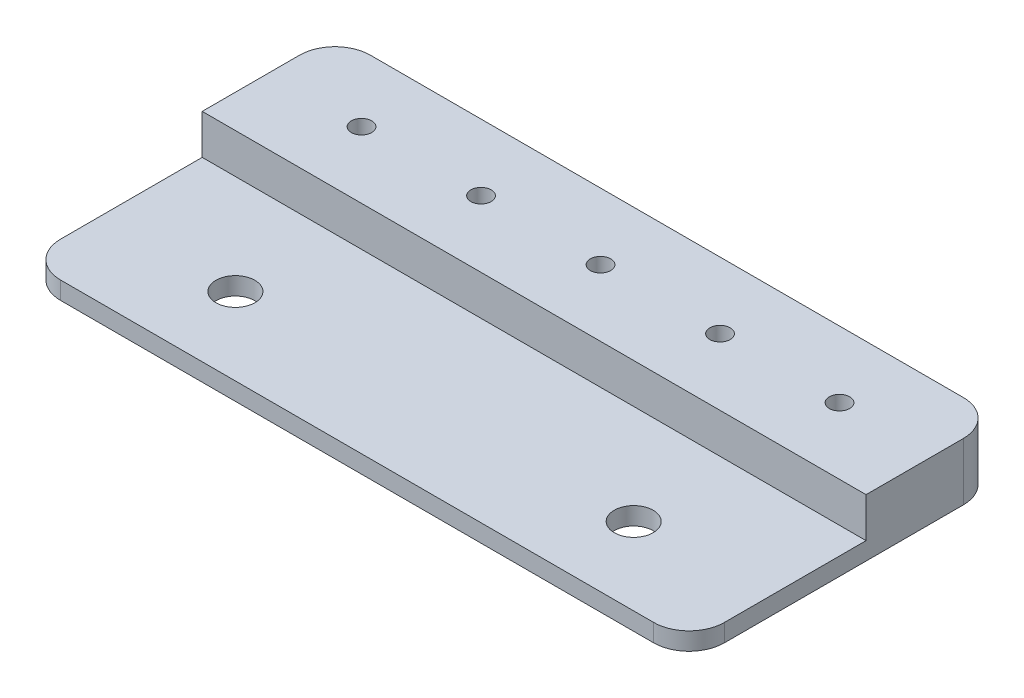
ISO-10303-21;
HEADER;
FILE_DESCRIPTION(('STEP AP214'),'2;1');
FILE_NAME('part.step','',(''),(''),'','','');
FILE_SCHEMA(('AUTOMOTIVE_DESIGN { 1 0 10303 214 1 1 1 1 }'));
ENDSEC;
DATA;
#1=APPLICATION_CONTEXT('core data for automotive mechanical design processes');
#2=APPLICATION_PROTOCOL_DEFINITION('international standard','automotive_design',2000,#1);
#3=PRODUCT_CONTEXT('',#1,'mechanical');
#4=PRODUCT('Part','Part','',(#3));
#5=PRODUCT_RELATED_PRODUCT_CATEGORY('part','',(#4));
#6=PRODUCT_DEFINITION_FORMATION('','',#4);
#7=PRODUCT_DEFINITION_CONTEXT('part definition',#1,'design');
#8=PRODUCT_DEFINITION('design','',#6,#7);
#9=PRODUCT_DEFINITION_SHAPE('','',#8);
#10=(LENGTH_UNIT() NAMED_UNIT(*) SI_UNIT(.MILLI.,.METRE.));
#11=(NAMED_UNIT(*) PLANE_ANGLE_UNIT() SI_UNIT($,.RADIAN.));
#12=(NAMED_UNIT(*) SI_UNIT($,.STERADIAN.) SOLID_ANGLE_UNIT());
#13=UNCERTAINTY_MEASURE_WITH_UNIT(LENGTH_MEASURE(1.E-05),#10,'distance_accuracy_value','');
#14=(GEOMETRIC_REPRESENTATION_CONTEXT(3) GLOBAL_UNCERTAINTY_ASSIGNED_CONTEXT((#13)) GLOBAL_UNIT_ASSIGNED_CONTEXT((#10,
#11,#12)) REPRESENTATION_CONTEXT('',''));
#15=CARTESIAN_POINT('',(0.,0.,0.));
#16=DIRECTION('',(0.,0.,1.));
#17=DIRECTION('',(1.,0.,0.));
#18=AXIS2_PLACEMENT_3D('',#15,#16,#17);
#19=CARTESIAN_POINT('',(-67.,0.,27.));
#20=DIRECTION('',(0.,-1.,0.));
#21=DIRECTION('',(0.,0.,-1.));
#22=AXIS2_PLACEMENT_3D('',#19,#20,#21);
#23=PLANE('',#22);
#24=CARTESIAN_POINT('',(-45.,0.,17.5));
#25=DIRECTION('',(0.,1.,0.));
#26=DIRECTION('',(0.,0.,1.));
#27=AXIS2_PLACEMENT_3D('',#24,#25,#26);
#28=CIRCLE('',#27,4.4);
#29=CARTESIAN_POINT('',(-45.,0.,21.9));
#30=VERTEX_POINT('',#29);
#31=EDGE_CURVE('E234',#30,#30,#28,.T.);
#32=ORIENTED_EDGE('',*,*,#31,.F.);
#33=EDGE_LOOP('',(#32));
#34=FACE_BOUND('',#33,.T.);
#35=CARTESIAN_POINT('',(45.,0.,17.5));
#36=DIRECTION('',(0.,1.,0.));
#37=DIRECTION('',(0.,0.,1.));
#38=AXIS2_PLACEMENT_3D('',#35,#36,#37);
#39=CIRCLE('',#38,4.4);
#40=CARTESIAN_POINT('',(45.,0.,21.9));
#41=VERTEX_POINT('',#40);
#42=EDGE_CURVE('E239',#41,#41,#39,.T.);
#43=ORIENTED_EDGE('',*,*,#42,.F.);
#44=EDGE_LOOP('',(#43));
#45=FACE_BOUND('',#44,.T.);
#46=DIRECTION('',(1.,0.,0.));
#47=VECTOR('',#46,1.);
#48=CARTESIAN_POINT('',(-75.,0.,-4.99999999999999));
#49=LINE('',#48,#47);
#50=CARTESIAN_POINT('',(-75.,0.,-4.99999999999999));
#51=VERTEX_POINT('',#50);
#52=CARTESIAN_POINT('',(74.9999999999999,0.,-4.99999999999999));
#53=VERTEX_POINT('',#52);
#54=EDGE_CURVE('E56',#51,#53,#49,.T.);
#55=ORIENTED_EDGE('',*,*,#54,.F.);
#56=DIRECTION('',(0.,0.,1.));
#57=VECTOR('',#56,1.);
#58=CARTESIAN_POINT('',(-75.,0.,-26.9999999999999));
#59=LINE('',#58,#57);
#60=CARTESIAN_POINT('',(-75.,0.,27.));
#61=VERTEX_POINT('',#60);
#62=EDGE_CURVE('E82',#51,#61,#59,.T.);
#63=ORIENTED_EDGE('',*,*,#62,.T.);
#64=CARTESIAN_POINT('',(-67.,0.,27.));
#65=DIRECTION('',(0.,1.,0.));
#66=DIRECTION('',(0.,0.,-1.));
#67=AXIS2_PLACEMENT_3D('',#64,#65,#66);
#68=CIRCLE('',#67,8.);
#69=CARTESIAN_POINT('',(-67.,0.,35.));
#70=VERTEX_POINT('',#69);
#71=EDGE_CURVE('E142',#61,#70,#68,.T.);
#72=ORIENTED_EDGE('',*,*,#71,.T.);
#73=DIRECTION('',(1.,0.,0.));
#74=VECTOR('',#73,1.);
#75=CARTESIAN_POINT('',(-67.,0.,35.));
#76=LINE('',#75,#74);
#77=CARTESIAN_POINT('',(66.9999999999999,0.,35.));
#78=VERTEX_POINT('',#77);
#79=EDGE_CURVE('E144',#70,#78,#76,.T.);
#80=ORIENTED_EDGE('',*,*,#79,.T.);
#81=CARTESIAN_POINT('',(66.9999999999999,0.,27.));
#82=DIRECTION('',(0.,1.,0.));
#83=DIRECTION('',(0.,0.,1.));
#84=AXIS2_PLACEMENT_3D('',#81,#82,#83);
#85=CIRCLE('',#84,8.);
#86=CARTESIAN_POINT('',(74.9999999999999,0.,27.));
#87=VERTEX_POINT('',#86);
#88=EDGE_CURVE('E148',#78,#87,#85,.T.);
#89=ORIENTED_EDGE('',*,*,#88,.T.);
#90=DIRECTION('',(0.,0.,-1.));
#91=VECTOR('',#90,1.);
#92=CARTESIAN_POINT('',(75.,0.,-26.9999999999999));
#93=LINE('',#92,#91);
#94=EDGE_CURVE('E151',#87,#53,#93,.T.);
#95=ORIENTED_EDGE('',*,*,#94,.T.);
#96=EDGE_LOOP('',(#55,#63,#72,#80,#89,#95));
#97=FACE_BOUND('',#96,.T.);
#98=ADVANCED_FACE('F39',(#34,#45,#97),#23,.F.);
#99=CARTESIAN_POINT('',(-67.,-4.,27.));
#100=DIRECTION('',(0.,1.,0.));
#101=DIRECTION('',(0.,0.,1.));
#102=AXIS2_PLACEMENT_3D('',#99,#100,#101);
#103=CYLINDRICAL_SURFACE('',#102,8.);
#104=ORIENTED_EDGE('',*,*,#71,.F.);
#105=DIRECTION('',(0.,1.,0.));
#106=VECTOR('',#105,1.);
#107=CARTESIAN_POINT('',(-75.,-4.,27.));
#108=LINE('',#107,#106);
#109=CARTESIAN_POINT('',(-75.,-4.,27.));
#110=VERTEX_POINT('',#109);
#111=EDGE_CURVE('E11',#110,#61,#108,.T.);
#112=ORIENTED_EDGE('',*,*,#111,.F.);
#113=CARTESIAN_POINT('',(-67.,-4.,27.));
#114=DIRECTION('',(0.,1.,0.));
#115=DIRECTION('',(0.,0.,-1.));
#116=AXIS2_PLACEMENT_3D('',#113,#114,#115);
#117=CIRCLE('',#116,8.);
#118=CARTESIAN_POINT('',(-67.,-4.,35.));
#119=VERTEX_POINT('',#118);
#120=EDGE_CURVE('E153',#110,#119,#117,.T.);
#121=ORIENTED_EDGE('',*,*,#120,.T.);
#122=DIRECTION('',(0.,1.,0.));
#123=VECTOR('',#122,1.);
#124=CARTESIAN_POINT('',(-67.,-4.,35.));
#125=LINE('',#124,#123);
#126=EDGE_CURVE('E43',#119,#70,#125,.T.);
#127=ORIENTED_EDGE('',*,*,#126,.T.);
#128=EDGE_LOOP('',(#104,#112,#121,#127));
#129=FACE_BOUND('',#128,.T.);
#130=ADVANCED_FACE('F41',(#129),#103,.T.);
#131=CARTESIAN_POINT('',(-75.,-4.,-26.9999999999999));
#132=DIRECTION('',(-1.,0.,0.));
#133=DIRECTION('',(0.,0.,1.));
#134=AXIS2_PLACEMENT_3D('',#131,#132,#133);
#135=PLANE('',#134);
#136=ORIENTED_EDGE('',*,*,#62,.F.);
#137=DIRECTION('',(0.,-1.,0.));
#138=VECTOR('',#137,1.);
#139=CARTESIAN_POINT('',(-75.,9.,-4.99999999999999));
#140=LINE('',#139,#138);
#141=CARTESIAN_POINT('',(-75.,9.,-4.99999999999999));
#142=VERTEX_POINT('',#141);
#143=EDGE_CURVE('E264',#142,#51,#140,.T.);
#144=ORIENTED_EDGE('',*,*,#143,.F.);
#145=DIRECTION('',(0.,0.,1.));
#146=VECTOR('',#145,1.);
#147=CARTESIAN_POINT('',(-75.,9.,-4.99999999999999));
#148=LINE('',#147,#146);
#149=CARTESIAN_POINT('',(-75.,9.,-26.9999999999999));
#150=VERTEX_POINT('',#149);
#151=EDGE_CURVE('E265',#150,#142,#148,.T.);
#152=ORIENTED_EDGE('',*,*,#151,.F.);
#153=DIRECTION('',(0.,1.,0.));
#154=VECTOR('',#153,1.);
#155=CARTESIAN_POINT('',(-75.,-4.,-26.9999999999999));
#156=LINE('',#155,#154);
#157=CARTESIAN_POINT('',(-75.,-4.,-26.9999999999999));
#158=VERTEX_POINT('',#157);
#159=EDGE_CURVE('E48',#158,#150,#156,.T.);
#160=ORIENTED_EDGE('',*,*,#159,.F.);
#161=DIRECTION('',(0.,0.,1.));
#162=VECTOR('',#161,1.);
#163=CARTESIAN_POINT('',(-75.,-4.,-26.9999999999999));
#164=LINE('',#163,#162);
#165=EDGE_CURVE('E131',#158,#110,#164,.T.);
#166=ORIENTED_EDGE('',*,*,#165,.T.);
#167=ORIENTED_EDGE('',*,*,#111,.T.);
#168=EDGE_LOOP('',(#136,#144,#152,#160,#166,#167));
#169=FACE_BOUND('',#168,.T.);
#170=ADVANCED_FACE('F172',(#169),#135,.T.);
#171=CARTESIAN_POINT('',(-67.,-4.,-27.));
#172=DIRECTION('',(0.,1.,0.));
#173=DIRECTION('',(0.,0.,1.));
#174=AXIS2_PLACEMENT_3D('',#171,#172,#173);
#175=CYLINDRICAL_SURFACE('',#174,8.);
#176=ORIENTED_EDGE('',*,*,#159,.T.);
#177=CARTESIAN_POINT('',(-67.,9.,-27.));
#178=DIRECTION('',(0.,1.,0.));
#179=DIRECTION('',(0.,0.,-1.));
#180=AXIS2_PLACEMENT_3D('',#177,#178,#179);
#181=CIRCLE('',#180,8.);
#182=CARTESIAN_POINT('',(-67.,9.,-35.));
#183=VERTEX_POINT('',#182);
#184=EDGE_CURVE('E117',#183,#150,#181,.T.);
#185=ORIENTED_EDGE('',*,*,#184,.F.);
#186=DIRECTION('',(0.,1.,0.));
#187=VECTOR('',#186,1.);
#188=CARTESIAN_POINT('',(-67.,-4.,-35.));
#189=LINE('',#188,#187);
#190=CARTESIAN_POINT('',(-67.,-4.,-35.));
#191=VERTEX_POINT('',#190);
#192=EDGE_CURVE('E109',#191,#183,#189,.T.);
#193=ORIENTED_EDGE('',*,*,#192,.F.);
#194=CARTESIAN_POINT('',(-67.,-4.,-27.));
#195=DIRECTION('',(0.,1.,0.));
#196=DIRECTION('',(0.,0.,1.));
#197=AXIS2_PLACEMENT_3D('',#194,#195,#196);
#198=CIRCLE('',#197,8.);
#199=EDGE_CURVE('E113',#191,#158,#198,.T.);
#200=ORIENTED_EDGE('',*,*,#199,.T.);
#201=EDGE_LOOP('',(#176,#185,#193,#200));
#202=FACE_BOUND('',#201,.T.);
#203=ADVANCED_FACE('F112',(#202),#175,.T.);
#204=CARTESIAN_POINT('',(-67.,-4.,-35.));
#205=DIRECTION('',(0.,0.,-1.));
#206=DIRECTION('',(-1.,0.,0.));
#207=AXIS2_PLACEMENT_3D('',#204,#205,#206);
#208=PLANE('',#207);
#209=ORIENTED_EDGE('',*,*,#192,.T.);
#210=DIRECTION('',(-1.,0.,0.));
#211=VECTOR('',#210,1.);
#212=CARTESIAN_POINT('',(-67.,9.,-35.));
#213=LINE('',#212,#211);
#214=CARTESIAN_POINT('',(66.9999999999999,9.,-35.));
#215=VERTEX_POINT('',#214);
#216=EDGE_CURVE('E270',#215,#183,#213,.T.);
#217=ORIENTED_EDGE('',*,*,#216,.F.);
#218=DIRECTION('',(0.,1.,0.));
#219=VECTOR('',#218,1.);
#220=CARTESIAN_POINT('',(66.9999999999999,-4.,-35.));
#221=LINE('',#220,#219);
#222=CARTESIAN_POINT('',(66.9999999999999,-4.,-35.));
#223=VERTEX_POINT('',#222);
#224=EDGE_CURVE('E122',#223,#215,#221,.T.);
#225=ORIENTED_EDGE('',*,*,#224,.F.);
#226=DIRECTION('',(-1.,0.,0.));
#227=VECTOR('',#226,1.);
#228=CARTESIAN_POINT('',(-67.,-4.,-35.));
#229=LINE('',#228,#227);
#230=EDGE_CURVE('E128',#223,#191,#229,.T.);
#231=ORIENTED_EDGE('',*,*,#230,.T.);
#232=EDGE_LOOP('',(#209,#217,#225,#231));
#233=FACE_BOUND('',#232,.T.);
#234=ADVANCED_FACE('F133',(#233),#208,.T.);
#235=CARTESIAN_POINT('',(67.,-4.,-27.));
#236=DIRECTION('',(0.,1.,0.));
#237=DIRECTION('',(0.,0.,1.));
#238=AXIS2_PLACEMENT_3D('',#235,#236,#237);
#239=CYLINDRICAL_SURFACE('',#238,8.);
#240=ORIENTED_EDGE('',*,*,#224,.T.);
#241=CARTESIAN_POINT('',(66.9999999999999,9.,-27.));
#242=DIRECTION('',(0.,1.,0.));
#243=DIRECTION('',(0.,0.,1.));
#244=AXIS2_PLACEMENT_3D('',#241,#242,#243);
#245=CIRCLE('',#244,8.);
#246=CARTESIAN_POINT('',(74.9999999999999,9.,-26.9999999999999));
#247=VERTEX_POINT('',#246);
#248=EDGE_CURVE('E334',#247,#215,#245,.T.);
#249=ORIENTED_EDGE('',*,*,#248,.F.);
#250=DIRECTION('',(0.,1.,0.));
#251=VECTOR('',#250,1.);
#252=CARTESIAN_POINT('',(75.,-4.,-26.9999999999999));
#253=LINE('',#252,#251);
#254=CARTESIAN_POINT('',(75.,-4.,-26.9999999999999));
#255=VERTEX_POINT('',#254);
#256=EDGE_CURVE('E157',#255,#247,#253,.T.);
#257=ORIENTED_EDGE('',*,*,#256,.F.);
#258=CARTESIAN_POINT('',(67.,-4.,-27.));
#259=DIRECTION('',(0.,1.,0.));
#260=DIRECTION('',(0.,0.,1.));
#261=AXIS2_PLACEMENT_3D('',#258,#259,#260);
#262=CIRCLE('',#261,8.);
#263=EDGE_CURVE('E135',#255,#223,#262,.T.);
#264=ORIENTED_EDGE('',*,*,#263,.T.);
#265=EDGE_LOOP('',(#240,#249,#257,#264));
#266=FACE_BOUND('',#265,.T.);
#267=ADVANCED_FACE('F184',(#266),#239,.T.);
#268=CARTESIAN_POINT('',(75.,-4.,-26.9999999999999));
#269=DIRECTION('',(1.,0.,0.));
#270=DIRECTION('',(0.,0.,-1.));
#271=AXIS2_PLACEMENT_3D('',#268,#269,#270);
#272=PLANE('',#271);
#273=ORIENTED_EDGE('',*,*,#94,.F.);
#274=DIRECTION('',(0.,1.,0.));
#275=VECTOR('',#274,1.);
#276=CARTESIAN_POINT('',(74.9999999999999,-4.,27.));
#277=LINE('',#276,#275);
#278=CARTESIAN_POINT('',(74.9999999999999,-4.,27.));
#279=VERTEX_POINT('',#278);
#280=EDGE_CURVE('E160',#279,#87,#277,.T.);
#281=ORIENTED_EDGE('',*,*,#280,.F.);
#282=DIRECTION('',(0.,0.,-1.));
#283=VECTOR('',#282,1.);
#284=CARTESIAN_POINT('',(75.,-4.,-26.9999999999999));
#285=LINE('',#284,#283);
#286=EDGE_CURVE('E137',#279,#255,#285,.T.);
#287=ORIENTED_EDGE('',*,*,#286,.T.);
#288=ORIENTED_EDGE('',*,*,#256,.T.);
#289=DIRECTION('',(0.,0.,-1.));
#290=VECTOR('',#289,1.);
#291=CARTESIAN_POINT('',(74.9999999999999,9.,-26.9999999999999));
#292=LINE('',#291,#290);
#293=CARTESIAN_POINT('',(74.9999999999999,9.,-4.99999999999999));
#294=VERTEX_POINT('',#293);
#295=EDGE_CURVE('E267',#294,#247,#292,.T.);
#296=ORIENTED_EDGE('',*,*,#295,.F.);
#297=DIRECTION('',(0.,-1.,0.));
#298=VECTOR('',#297,1.);
#299=CARTESIAN_POINT('',(74.9999999999999,9.,-4.99999999999999));
#300=LINE('',#299,#298);
#301=EDGE_CURVE('E262',#294,#53,#300,.T.);
#302=ORIENTED_EDGE('',*,*,#301,.T.);
#303=EDGE_LOOP('',(#273,#281,#287,#288,#296,#302));
#304=FACE_BOUND('',#303,.T.);
#305=ADVANCED_FACE('F187',(#304),#272,.T.);
#306=CARTESIAN_POINT('',(66.9999999999999,-4.,27.));
#307=DIRECTION('',(0.,1.,0.));
#308=DIRECTION('',(0.,0.,1.));
#309=AXIS2_PLACEMENT_3D('',#306,#307,#308);
#310=CYLINDRICAL_SURFACE('',#309,8.);
#311=ORIENTED_EDGE('',*,*,#88,.F.);
#312=DIRECTION('',(0.,1.,0.));
#313=VECTOR('',#312,1.);
#314=CARTESIAN_POINT('',(66.9999999999999,-4.,35.));
#315=LINE('',#314,#313);
#316=CARTESIAN_POINT('',(66.9999999999999,-4.,35.));
#317=VERTEX_POINT('',#316);
#318=EDGE_CURVE('E161',#317,#78,#315,.T.);
#319=ORIENTED_EDGE('',*,*,#318,.F.);
#320=CARTESIAN_POINT('',(66.9999999999999,-4.,27.));
#321=DIRECTION('',(0.,1.,0.));
#322=DIRECTION('',(0.,0.,1.));
#323=AXIS2_PLACEMENT_3D('',#320,#321,#322);
#324=CIRCLE('',#323,8.);
#325=EDGE_CURVE('E245',#317,#279,#324,.T.);
#326=ORIENTED_EDGE('',*,*,#325,.T.);
#327=ORIENTED_EDGE('',*,*,#280,.T.);
#328=EDGE_LOOP('',(#311,#319,#326,#327));
#329=FACE_BOUND('',#328,.T.);
#330=ADVANCED_FACE('F191',(#329),#310,.T.);
#331=CARTESIAN_POINT('',(-67.,-4.,35.));
#332=DIRECTION('',(0.,0.,1.));
#333=DIRECTION('',(1.,0.,0.));
#334=AXIS2_PLACEMENT_3D('',#331,#332,#333);
#335=PLANE('',#334);
#336=ORIENTED_EDGE('',*,*,#79,.F.);
#337=ORIENTED_EDGE('',*,*,#126,.F.);
#338=DIRECTION('',(1.,0.,0.));
#339=VECTOR('',#338,1.);
#340=CARTESIAN_POINT('',(-67.,-4.,35.));
#341=LINE('',#340,#339);
#342=EDGE_CURVE('E243',#119,#317,#341,.T.);
#343=ORIENTED_EDGE('',*,*,#342,.T.);
#344=ORIENTED_EDGE('',*,*,#318,.T.);
#345=EDGE_LOOP('',(#336,#337,#343,#344));
#346=FACE_BOUND('',#345,.T.);
#347=ADVANCED_FACE('F163',(#346),#335,.T.);
#348=CARTESIAN_POINT('',(-67.,-4.,27.));
#349=DIRECTION('',(0.,-1.,0.));
#350=DIRECTION('',(0.,0.,-1.));
#351=AXIS2_PLACEMENT_3D('',#348,#349,#350);
#352=PLANE('',#351);
#353=CARTESIAN_POINT('',(-54.,-4.,-20.));
#354=DIRECTION('',(0.,-1.,0.));
#355=DIRECTION('',(0.,0.,-1.));
#356=AXIS2_PLACEMENT_3D('',#353,#354,#355);
#357=CIRCLE('',#356,2.3);
#358=CARTESIAN_POINT('',(-54.,-4.,-22.3));
#359=VERTEX_POINT('',#358);
#360=EDGE_CURVE('E211',#359,#359,#357,.F.);
#361=ORIENTED_EDGE('',*,*,#360,.T.);
#362=EDGE_LOOP('',(#361));
#363=FACE_BOUND('',#362,.T.);
#364=CARTESIAN_POINT('',(-27.,-4.,-20.));
#365=DIRECTION('',(0.,-1.,0.));
#366=DIRECTION('',(0.,0.,-1.));
#367=AXIS2_PLACEMENT_3D('',#364,#365,#366);
#368=CIRCLE('',#367,2.3);
#369=CARTESIAN_POINT('',(-27.,-4.,-22.3));
#370=VERTEX_POINT('',#369);
#371=EDGE_CURVE('E215',#370,#370,#368,.F.);
#372=ORIENTED_EDGE('',*,*,#371,.T.);
#373=EDGE_LOOP('',(#372));
#374=FACE_BOUND('',#373,.T.);
#375=CARTESIAN_POINT('',(0.,-4.,-20.));
#376=DIRECTION('',(0.,-1.,0.));
#377=DIRECTION('',(0.,0.,-1.));
#378=AXIS2_PLACEMENT_3D('',#375,#376,#377);
#379=CIRCLE('',#378,2.3);
#380=CARTESIAN_POINT('',(0.,-4.,-22.3));
#381=VERTEX_POINT('',#380);
#382=EDGE_CURVE('E219',#381,#381,#379,.F.);
#383=ORIENTED_EDGE('',*,*,#382,.T.);
#384=EDGE_LOOP('',(#383));
#385=FACE_BOUND('',#384,.T.);
#386=CARTESIAN_POINT('',(27.,-4.,-20.));
#387=DIRECTION('',(0.,-1.,0.));
#388=DIRECTION('',(0.,0.,-1.));
#389=AXIS2_PLACEMENT_3D('',#386,#387,#388);
#390=CIRCLE('',#389,2.3);
#391=CARTESIAN_POINT('',(27.,-4.,-22.3));
#392=VERTEX_POINT('',#391);
#393=EDGE_CURVE('E223',#392,#392,#390,.F.);
#394=ORIENTED_EDGE('',*,*,#393,.T.);
#395=EDGE_LOOP('',(#394));
#396=FACE_BOUND('',#395,.T.);
#397=CARTESIAN_POINT('',(54.,-4.,-20.));
#398=DIRECTION('',(0.,-1.,0.));
#399=DIRECTION('',(0.,0.,-1.));
#400=AXIS2_PLACEMENT_3D('',#397,#398,#399);
#401=CIRCLE('',#400,2.3);
#402=CARTESIAN_POINT('',(54.,-4.,-22.3));
#403=VERTEX_POINT('',#402);
#404=EDGE_CURVE('E227',#403,#403,#401,.F.);
#405=ORIENTED_EDGE('',*,*,#404,.T.);
#406=EDGE_LOOP('',(#405));
#407=FACE_BOUND('',#406,.T.);
#408=CARTESIAN_POINT('',(45.,-4.,17.5));
#409=DIRECTION('',(0.,1.,0.));
#410=DIRECTION('',(0.,0.,1.));
#411=AXIS2_PLACEMENT_3D('',#408,#409,#410);
#412=CIRCLE('',#411,4.4);
#413=CARTESIAN_POINT('',(45.,-4.,21.9));
#414=VERTEX_POINT('',#413);
#415=EDGE_CURVE('E231',#414,#414,#412,.T.);
#416=ORIENTED_EDGE('',*,*,#415,.T.);
#417=EDGE_LOOP('',(#416));
#418=FACE_BOUND('',#417,.T.);
#419=CARTESIAN_POINT('',(-45.,-4.,17.5));
#420=DIRECTION('',(0.,1.,0.));
#421=DIRECTION('',(0.,0.,1.));
#422=AXIS2_PLACEMENT_3D('',#419,#420,#421);
#423=CIRCLE('',#422,4.4);
#424=CARTESIAN_POINT('',(-45.,-4.,21.9));
#425=VERTEX_POINT('',#424);
#426=EDGE_CURVE('E145',#425,#425,#423,.T.);
#427=ORIENTED_EDGE('',*,*,#426,.T.);
#428=EDGE_LOOP('',(#427));
#429=FACE_BOUND('',#428,.T.);
#430=ORIENTED_EDGE('',*,*,#120,.F.);
#431=ORIENTED_EDGE('',*,*,#165,.F.);
#432=ORIENTED_EDGE('',*,*,#199,.F.);
#433=ORIENTED_EDGE('',*,*,#230,.F.);
#434=ORIENTED_EDGE('',*,*,#263,.F.);
#435=ORIENTED_EDGE('',*,*,#286,.F.);
#436=ORIENTED_EDGE('',*,*,#325,.F.);
#437=ORIENTED_EDGE('',*,*,#342,.F.);
#438=EDGE_LOOP('',(#430,#431,#432,#433,#434,#435,#436,#437));
#439=FACE_BOUND('',#438,.T.);
#440=ADVANCED_FACE('F126',(#363,#374,#385,#396,#407,#418,#429,#439),#352,.T.);
#441=CARTESIAN_POINT('',(-45.,-4.,17.5));
#442=DIRECTION('',(0.,1.,0.));
#443=DIRECTION('',(0.,0.,1.));
#444=AXIS2_PLACEMENT_3D('',#441,#442,#443);
#445=CYLINDRICAL_SURFACE('',#444,4.4);
#446=ORIENTED_EDGE('',*,*,#426,.F.);
#447=EDGE_LOOP('',(#446));
#448=FACE_BOUND('',#447,.T.);
#449=ORIENTED_EDGE('',*,*,#31,.T.);
#450=EDGE_LOOP('',(#449));
#451=FACE_BOUND('',#450,.T.);
#452=ADVANCED_FACE('F200',(#448,#451),#445,.F.);
#453=CARTESIAN_POINT('',(45.,-4.,17.5));
#454=DIRECTION('',(0.,1.,0.));
#455=DIRECTION('',(0.,0.,1.));
#456=AXIS2_PLACEMENT_3D('',#453,#454,#455);
#457=CYLINDRICAL_SURFACE('',#456,4.4);
#458=ORIENTED_EDGE('',*,*,#415,.F.);
#459=EDGE_LOOP('',(#458));
#460=FACE_BOUND('',#459,.T.);
#461=ORIENTED_EDGE('',*,*,#42,.T.);
#462=EDGE_LOOP('',(#461));
#463=FACE_BOUND('',#462,.T.);
#464=ADVANCED_FACE('F206',(#460,#463),#457,.F.);
#465=CARTESIAN_POINT('',(-75.,9.,-4.99999999999999));
#466=DIRECTION('',(0.,0.,-1.));
#467=DIRECTION('',(-1.,0.,0.));
#468=AXIS2_PLACEMENT_3D('',#465,#466,#467);
#469=PLANE('',#468);
#470=ORIENTED_EDGE('',*,*,#54,.T.);
#471=ORIENTED_EDGE('',*,*,#301,.F.);
#472=DIRECTION('',(1.,0.,0.));
#473=VECTOR('',#472,1.);
#474=CARTESIAN_POINT('',(-75.,9.,-4.99999999999999));
#475=LINE('',#474,#473);
#476=EDGE_CURVE('E330',#142,#294,#475,.T.);
#477=ORIENTED_EDGE('',*,*,#476,.F.);
#478=ORIENTED_EDGE('',*,*,#143,.T.);
#479=EDGE_LOOP('',(#470,#471,#477,#478));
#480=FACE_BOUND('',#479,.T.);
#481=ADVANCED_FACE('F259',(#480),#469,.F.);
#482=CARTESIAN_POINT('',(-67.,9.,-27.));
#483=DIRECTION('',(0.,-1.,0.));
#484=DIRECTION('',(0.,0.,-1.));
#485=AXIS2_PLACEMENT_3D('',#482,#483,#484);
#486=PLANE('',#485);
#487=CARTESIAN_POINT('',(-54.,9.,-20.));
#488=DIRECTION('',(0.,1.,0.));
#489=DIRECTION('',(0.,0.,1.));
#490=AXIS2_PLACEMENT_3D('',#487,#488,#489);
#491=CIRCLE('',#490,2.3);
#492=CARTESIAN_POINT('',(-54.,9.,-17.7));
#493=VERTEX_POINT('',#492);
#494=EDGE_CURVE('E308',#493,#493,#491,.T.);
#495=ORIENTED_EDGE('',*,*,#494,.F.);
#496=EDGE_LOOP('',(#495));
#497=FACE_BOUND('',#496,.T.);
#498=CARTESIAN_POINT('',(-27.,9.,-20.));
#499=DIRECTION('',(0.,1.,0.));
#500=DIRECTION('',(0.,0.,1.));
#501=AXIS2_PLACEMENT_3D('',#498,#499,#500);
#502=CIRCLE('',#501,2.3);
#503=CARTESIAN_POINT('',(-27.,9.,-17.7));
#504=VERTEX_POINT('',#503);
#505=EDGE_CURVE('E310',#504,#504,#502,.T.);
#506=ORIENTED_EDGE('',*,*,#505,.F.);
#507=EDGE_LOOP('',(#506));
#508=FACE_BOUND('',#507,.T.);
#509=CARTESIAN_POINT('',(0.,9.,-20.));
#510=DIRECTION('',(0.,1.,0.));
#511=DIRECTION('',(0.,0.,1.));
#512=AXIS2_PLACEMENT_3D('',#509,#510,#511);
#513=CIRCLE('',#512,2.3);
#514=CARTESIAN_POINT('',(0.,9.,-17.7));
#515=VERTEX_POINT('',#514);
#516=EDGE_CURVE('E314',#515,#515,#513,.T.);
#517=ORIENTED_EDGE('',*,*,#516,.F.);
#518=EDGE_LOOP('',(#517));
#519=FACE_BOUND('',#518,.T.);
#520=CARTESIAN_POINT('',(27.,9.,-20.));
#521=DIRECTION('',(0.,1.,0.));
#522=DIRECTION('',(0.,0.,1.));
#523=AXIS2_PLACEMENT_3D('',#520,#521,#522);
#524=CIRCLE('',#523,2.3);
#525=CARTESIAN_POINT('',(27.,9.,-17.7));
#526=VERTEX_POINT('',#525);
#527=EDGE_CURVE('E318',#526,#526,#524,.T.);
#528=ORIENTED_EDGE('',*,*,#527,.F.);
#529=EDGE_LOOP('',(#528));
#530=FACE_BOUND('',#529,.T.);
#531=CARTESIAN_POINT('',(54.,9.,-20.));
#532=DIRECTION('',(0.,1.,0.));
#533=DIRECTION('',(0.,0.,1.));
#534=AXIS2_PLACEMENT_3D('',#531,#532,#533);
#535=CIRCLE('',#534,2.3);
#536=CARTESIAN_POINT('',(54.,9.,-17.7));
#537=VERTEX_POINT('',#536);
#538=EDGE_CURVE('E322',#537,#537,#535,.T.);
#539=ORIENTED_EDGE('',*,*,#538,.F.);
#540=EDGE_LOOP('',(#539));
#541=FACE_BOUND('',#540,.T.);
#542=ORIENTED_EDGE('',*,*,#151,.T.);
#543=ORIENTED_EDGE('',*,*,#476,.T.);
#544=ORIENTED_EDGE('',*,*,#295,.T.);
#545=ORIENTED_EDGE('',*,*,#248,.T.);
#546=ORIENTED_EDGE('',*,*,#216,.T.);
#547=ORIENTED_EDGE('',*,*,#184,.T.);
#548=EDGE_LOOP('',(#542,#543,#544,#545,#546,#547));
#549=FACE_BOUND('',#548,.T.);
#550=ADVANCED_FACE('F279',(#497,#508,#519,#530,#541,#549),#486,.F.);
#551=CARTESIAN_POINT('',(54.,-10.5053823869162,-20.));
#552=DIRECTION('',(0.,1.,0.));
#553=DIRECTION('',(0.,0.,1.));
#554=AXIS2_PLACEMENT_3D('',#551,#552,#553);
#555=CYLINDRICAL_SURFACE('',#554,2.3);
#556=ORIENTED_EDGE('',*,*,#538,.T.);
#557=EDGE_LOOP('',(#556));
#558=FACE_BOUND('',#557,.T.);
#559=ORIENTED_EDGE('',*,*,#404,.F.);
#560=EDGE_LOOP('',(#559));
#561=FACE_BOUND('',#560,.T.);
#562=ADVANCED_FACE('F283',(#558,#561),#555,.F.);
#563=CARTESIAN_POINT('',(27.,-10.5053823869162,-20.));
#564=DIRECTION('',(0.,1.,0.));
#565=DIRECTION('',(0.,0.,1.));
#566=AXIS2_PLACEMENT_3D('',#563,#564,#565);
#567=CYLINDRICAL_SURFACE('',#566,2.3);
#568=ORIENTED_EDGE('',*,*,#527,.T.);
#569=EDGE_LOOP('',(#568));
#570=FACE_BOUND('',#569,.T.);
#571=ORIENTED_EDGE('',*,*,#393,.F.);
#572=EDGE_LOOP('',(#571));
#573=FACE_BOUND('',#572,.T.);
#574=ADVANCED_FACE('F287',(#570,#573),#567,.F.);
#575=CARTESIAN_POINT('',(0.,-10.5053823869162,-20.));
#576=DIRECTION('',(0.,1.,0.));
#577=DIRECTION('',(0.,0.,1.));
#578=AXIS2_PLACEMENT_3D('',#575,#576,#577);
#579=CYLINDRICAL_SURFACE('',#578,2.3);
#580=ORIENTED_EDGE('',*,*,#516,.T.);
#581=EDGE_LOOP('',(#580));
#582=FACE_BOUND('',#581,.T.);
#583=ORIENTED_EDGE('',*,*,#382,.F.);
#584=EDGE_LOOP('',(#583));
#585=FACE_BOUND('',#584,.T.);
#586=ADVANCED_FACE('F291',(#582,#585),#579,.F.);
#587=CARTESIAN_POINT('',(-27.,-10.5053823869162,-20.));
#588=DIRECTION('',(0.,1.,0.));
#589=DIRECTION('',(0.,0.,1.));
#590=AXIS2_PLACEMENT_3D('',#587,#588,#589);
#591=CYLINDRICAL_SURFACE('',#590,2.3);
#592=ORIENTED_EDGE('',*,*,#505,.T.);
#593=EDGE_LOOP('',(#592));
#594=FACE_BOUND('',#593,.T.);
#595=ORIENTED_EDGE('',*,*,#371,.F.);
#596=EDGE_LOOP('',(#595));
#597=FACE_BOUND('',#596,.T.);
#598=ADVANCED_FACE('F295',(#594,#597),#591,.F.);
#599=CARTESIAN_POINT('',(-54.,-10.5053823869162,-20.));
#600=DIRECTION('',(0.,1.,0.));
#601=DIRECTION('',(0.,0.,1.));
#602=AXIS2_PLACEMENT_3D('',#599,#600,#601);
#603=CYLINDRICAL_SURFACE('',#602,2.3);
#604=ORIENTED_EDGE('',*,*,#494,.T.);
#605=EDGE_LOOP('',(#604));
#606=FACE_BOUND('',#605,.T.);
#607=ORIENTED_EDGE('',*,*,#360,.F.);
#608=EDGE_LOOP('',(#607));
#609=FACE_BOUND('',#608,.T.);
#610=ADVANCED_FACE('F299',(#606,#609),#603,.F.);
#611=CLOSED_SHELL('',(#98,#130,#170,#203,#234,#267,#305,#330,#347,#440,#452,#464,#481,#550,#562,
#574,#586,#598,#610));
#612=MANIFOLD_SOLID_BREP('B2',#611);
#613=ADVANCED_BREP_SHAPE_REPRESENTATION('',(#18,#612),#14);
#614=SHAPE_DEFINITION_REPRESENTATION(#9,#613);
ENDSEC;
END-ISO-10303-21;
